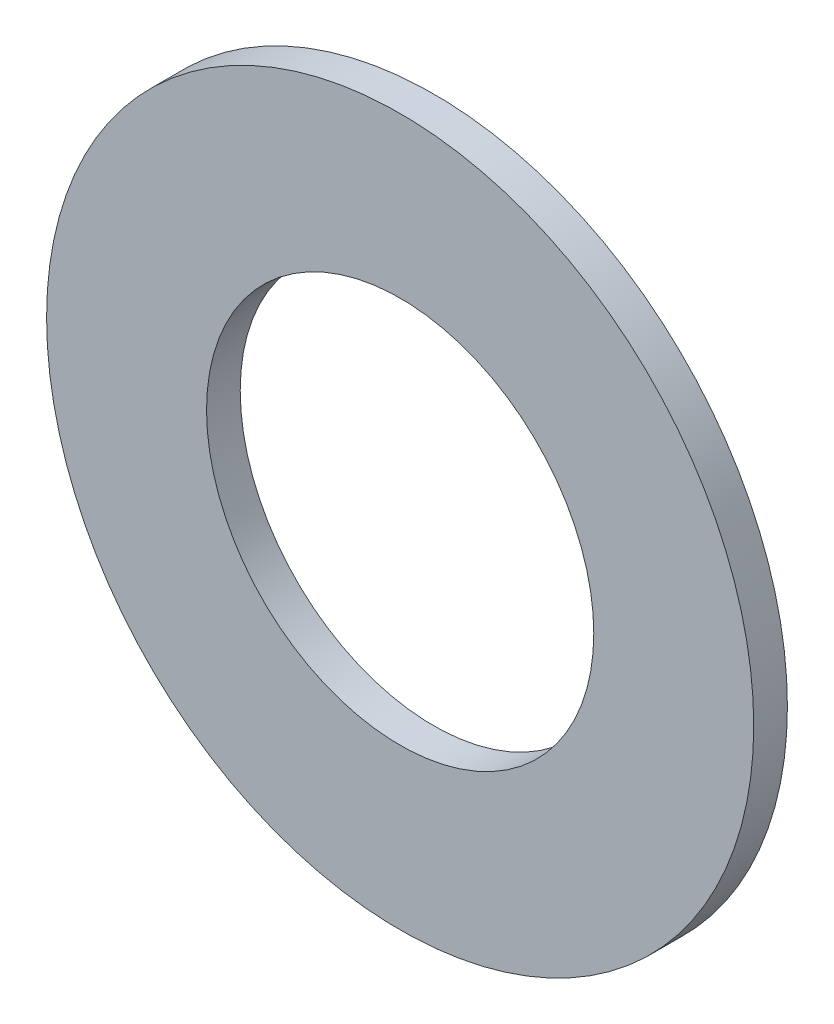
ISO-10303-21;
HEADER;
FILE_DESCRIPTION(('STEP AP214'),'2;1');
FILE_NAME('part.step','',(''),(''),'','','');
FILE_SCHEMA(('AUTOMOTIVE_DESIGN { 1 0 10303 214 1 1 1 1 }'));
ENDSEC;
DATA;
#1=APPLICATION_CONTEXT('core data for automotive mechanical design processes');
#2=APPLICATION_PROTOCOL_DEFINITION('international standard','automotive_design',2000,#1);
#3=PRODUCT_CONTEXT('',#1,'mechanical');
#4=PRODUCT('Part','Part','',(#3));
#5=PRODUCT_RELATED_PRODUCT_CATEGORY('part','',(#4));
#6=PRODUCT_DEFINITION_FORMATION('','',#4);
#7=PRODUCT_DEFINITION_CONTEXT('part definition',#1,'design');
#8=PRODUCT_DEFINITION('design','',#6,#7);
#9=PRODUCT_DEFINITION_SHAPE('','',#8);
#10=(LENGTH_UNIT() NAMED_UNIT(*) SI_UNIT(.MILLI.,.METRE.));
#11=(NAMED_UNIT(*) PLANE_ANGLE_UNIT() SI_UNIT($,.RADIAN.));
#12=(NAMED_UNIT(*) SI_UNIT($,.STERADIAN.) SOLID_ANGLE_UNIT());
#13=UNCERTAINTY_MEASURE_WITH_UNIT(LENGTH_MEASURE(1.E-05),#10,'distance_accuracy_value','');
#14=(GEOMETRIC_REPRESENTATION_CONTEXT(3) GLOBAL_UNCERTAINTY_ASSIGNED_CONTEXT((#13)) GLOBAL_UNIT_ASSIGNED_CONTEXT((#10,
#11,#12)) REPRESENTATION_CONTEXT('',''));
#15=CARTESIAN_POINT('',(0.,0.,0.));
#16=DIRECTION('',(0.,0.,1.));
#17=DIRECTION('',(1.,0.,0.));
#18=AXIS2_PLACEMENT_3D('',#15,#16,#17);
#19=CARTESIAN_POINT('',(0.,0.,40.));
#20=DIRECTION('',(0.,0.,1.));
#21=DIRECTION('',(1.,0.,0.));
#22=AXIS2_PLACEMENT_3D('',#19,#20,#21);
#23=PLANE('',#22);
#24=CARTESIAN_POINT('',(0.,0.,40.));
#25=DIRECTION('',(0.,0.,1.));
#26=DIRECTION('',(1.,0.,0.));
#27=AXIS2_PLACEMENT_3D('',#24,#25,#26);
#28=CIRCLE('',#27,21.);
#29=CARTESIAN_POINT('',(21.,0.,40.));
#30=VERTEX_POINT('',#29);
#31=EDGE_CURVE('E10',#30,#30,#28,.T.);
#32=ORIENTED_EDGE('',*,*,#31,.T.);
#33=EDGE_LOOP('',(#32));
#34=FACE_BOUND('',#33,.T.);
#35=CARTESIAN_POINT('',(0.,0.,40.));
#36=DIRECTION('',(0.,0.,1.));
#37=DIRECTION('',(1.,0.,0.));
#38=AXIS2_PLACEMENT_3D('',#35,#36,#37);
#39=CIRCLE('',#38,11.5);
#40=CARTESIAN_POINT('',(11.5,0.,40.));
#41=VERTEX_POINT('',#40);
#42=EDGE_CURVE('E50',#41,#41,#39,.T.);
#43=ORIENTED_EDGE('',*,*,#42,.F.);
#44=EDGE_LOOP('',(#43));
#45=FACE_BOUND('',#44,.T.);
#46=ADVANCED_FACE('F39',(#34,#45),#23,.T.);
#47=CARTESIAN_POINT('',(0.,0.,38.));
#48=DIRECTION('',(0.,0.,1.));
#49=DIRECTION('',(1.,0.,0.));
#50=AXIS2_PLACEMENT_3D('',#47,#48,#49);
#51=PLANE('',#50);
#52=CARTESIAN_POINT('',(0.,0.,38.));
#53=DIRECTION('',(0.,0.,1.));
#54=DIRECTION('',(1.,0.,0.));
#55=AXIS2_PLACEMENT_3D('',#52,#53,#54);
#56=CIRCLE('',#55,21.);
#57=CARTESIAN_POINT('',(21.,0.,38.));
#58=VERTEX_POINT('',#57);
#59=EDGE_CURVE('E43',#58,#58,#56,.T.);
#60=ORIENTED_EDGE('',*,*,#59,.F.);
#61=EDGE_LOOP('',(#60));
#62=FACE_BOUND('',#61,.T.);
#63=CARTESIAN_POINT('',(0.,0.,38.));
#64=DIRECTION('',(0.,0.,1.));
#65=DIRECTION('',(1.,0.,0.));
#66=AXIS2_PLACEMENT_3D('',#63,#64,#65);
#67=CIRCLE('',#66,11.5);
#68=CARTESIAN_POINT('',(11.5,0.,38.));
#69=VERTEX_POINT('',#68);
#70=EDGE_CURVE('E52',#69,#69,#67,.T.);
#71=ORIENTED_EDGE('',*,*,#70,.T.);
#72=EDGE_LOOP('',(#71));
#73=FACE_BOUND('',#72,.T.);
#74=ADVANCED_FACE('F62',(#62,#73),#51,.F.);
#75=CARTESIAN_POINT('',(0.,0.,40.));
#76=DIRECTION('',(0.,0.,-1.));
#77=DIRECTION('',(-1.,0.,0.));
#78=AXIS2_PLACEMENT_3D('',#75,#76,#77);
#79=CYLINDRICAL_SURFACE('',#78,21.);
#80=ORIENTED_EDGE('',*,*,#31,.F.);
#81=EDGE_LOOP('',(#80));
#82=FACE_BOUND('',#81,.T.);
#83=ORIENTED_EDGE('',*,*,#59,.T.);
#84=EDGE_LOOP('',(#83));
#85=FACE_BOUND('',#84,.T.);
#86=ADVANCED_FACE('F41',(#82,#85),#79,.T.);
#87=CARTESIAN_POINT('',(0.,0.,40.));
#88=DIRECTION('',(0.,0.,-1.));
#89=DIRECTION('',(-1.,0.,0.));
#90=AXIS2_PLACEMENT_3D('',#87,#88,#89);
#91=CYLINDRICAL_SURFACE('',#90,11.5);
#92=ORIENTED_EDGE('',*,*,#42,.T.);
#93=EDGE_LOOP('',(#92));
#94=FACE_BOUND('',#93,.T.);
#95=ORIENTED_EDGE('',*,*,#70,.F.);
#96=EDGE_LOOP('',(#95));
#97=FACE_BOUND('',#96,.T.);
#98=ADVANCED_FACE('F58',(#94,#97),#91,.F.);
#99=CLOSED_SHELL('',(#46,#74,#86,#98));
#100=MANIFOLD_SOLID_BREP('B2',#99);
#101=ADVANCED_BREP_SHAPE_REPRESENTATION('',(#18,#100),#14);
#102=SHAPE_DEFINITION_REPRESENTATION(#9,#101);
ENDSEC;
END-ISO-10303-21;
